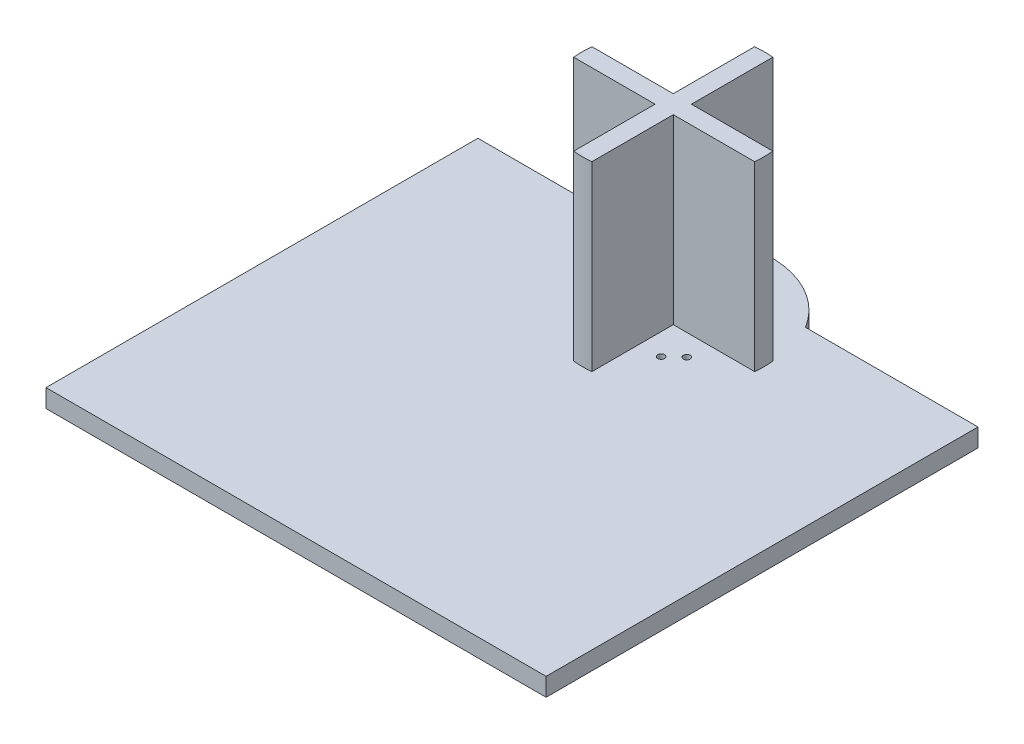
ISO-10303-21;
HEADER;
FILE_DESCRIPTION(('STEP AP214'),'2;1');
FILE_NAME('part.step','',(''),(''),'','','');
FILE_SCHEMA(('AUTOMOTIVE_DESIGN { 1 0 10303 214 1 1 1 1 }'));
ENDSEC;
DATA;
#1=APPLICATION_CONTEXT('core data for automotive mechanical design processes');
#2=APPLICATION_PROTOCOL_DEFINITION('international standard','automotive_design',2000,#1);
#3=PRODUCT_CONTEXT('',#1,'mechanical');
#4=PRODUCT('Part','Part','',(#3));
#5=PRODUCT_RELATED_PRODUCT_CATEGORY('part','',(#4));
#6=PRODUCT_DEFINITION_FORMATION('','',#4);
#7=PRODUCT_DEFINITION_CONTEXT('part definition',#1,'design');
#8=PRODUCT_DEFINITION('design','',#6,#7);
#9=PRODUCT_DEFINITION_SHAPE('','',#8);
#10=(LENGTH_UNIT() NAMED_UNIT(*) SI_UNIT(.MILLI.,.METRE.));
#11=(NAMED_UNIT(*) PLANE_ANGLE_UNIT() SI_UNIT($,.RADIAN.));
#12=(NAMED_UNIT(*) SI_UNIT($,.STERADIAN.) SOLID_ANGLE_UNIT());
#13=UNCERTAINTY_MEASURE_WITH_UNIT(LENGTH_MEASURE(1.E-05),#10,'distance_accuracy_value','');
#14=(GEOMETRIC_REPRESENTATION_CONTEXT(3) GLOBAL_UNCERTAINTY_ASSIGNED_CONTEXT((#13)) GLOBAL_UNIT_ASSIGNED_CONTEXT((#10,
#11,#12)) REPRESENTATION_CONTEXT('',''));
#15=CARTESIAN_POINT('',(0.,0.,0.));
#16=DIRECTION('',(0.,0.,1.));
#17=DIRECTION('',(1.,0.,0.));
#18=AXIS2_PLACEMENT_3D('',#15,#16,#17);
#19=CARTESIAN_POINT('',(55.,44.,-82.9710505503531));
#20=DIRECTION('',(0.,-1.,0.));
#21=DIRECTION('',(0.,0.,-1.));
#22=AXIS2_PLACEMENT_3D('',#19,#20,#21);
#23=CYLINDRICAL_SURFACE('',#22,20.);
#24=DIRECTION('',(0.,-1.,0.));
#25=VECTOR('',#24,1.);
#26=CARTESIAN_POINT('',(74.8997487421324,44.,-80.9710505503531));
#27=LINE('',#26,#25);
#28=CARTESIAN_POINT('',(74.8997487421324,4.,-80.9710505503531));
#29=VERTEX_POINT('',#28);
#30=CARTESIAN_POINT('',(74.8997487421324,44.,-80.9710505503531));
#31=VERTEX_POINT('',#30);
#32=EDGE_CURVE('E239',#29,#31,#27,.F.);
#33=ORIENTED_EDGE('',*,*,#32,.F.);
#34=CARTESIAN_POINT('',(55.,4.,-82.9710505503531));
#35=DIRECTION('',(0.,1.,0.));
#36=DIRECTION('',(0.,0.,1.));
#37=AXIS2_PLACEMENT_3D('',#34,#35,#36);
#38=CIRCLE('',#37,20.);
#39=CARTESIAN_POINT('',(74.8997487421324,4.,-84.9710505503531));
#40=VERTEX_POINT('',#39);
#41=EDGE_CURVE('E247',#29,#40,#38,.T.);
#42=ORIENTED_EDGE('',*,*,#41,.T.);
#43=DIRECTION('',(0.,-1.,0.));
#44=VECTOR('',#43,1.);
#45=CARTESIAN_POINT('',(74.8997487421324,44.,-84.9710505503531));
#46=LINE('',#45,#44);
#47=CARTESIAN_POINT('',(74.8997487421324,44.,-84.9710505503531));
#48=VERTEX_POINT('',#47);
#49=EDGE_CURVE('E229',#40,#48,#46,.F.);
#50=ORIENTED_EDGE('',*,*,#49,.T.);
#51=CARTESIAN_POINT('',(55.,44.,-82.9710505503531));
#52=DIRECTION('',(0.,1.,0.));
#53=DIRECTION('',(0.,0.,1.));
#54=AXIS2_PLACEMENT_3D('',#51,#52,#53);
#55=CIRCLE('',#54,20.);
#56=EDGE_CURVE('E248',#31,#48,#55,.T.);
#57=ORIENTED_EDGE('',*,*,#56,.F.);
#58=EDGE_LOOP('',(#33,#42,#50,#57));
#59=FACE_BOUND('',#58,.T.);
#60=ADVANCED_FACE('F39',(#59),#23,.T.);
#61=DIRECTION('',(0.,-1.,0.));
#62=VECTOR('',#61,1.);
#63=CARTESIAN_POINT('',(35.1002512578676,44.,-84.9710505503531));
#64=LINE('',#63,#62);
#65=CARTESIAN_POINT('',(35.1002512578676,4.,-84.9710505503531));
#66=VERTEX_POINT('',#65);
#67=CARTESIAN_POINT('',(35.1002512578676,44.,-84.9710505503531));
#68=VERTEX_POINT('',#67);
#69=EDGE_CURVE('E64',#66,#68,#64,.F.);
#70=ORIENTED_EDGE('',*,*,#69,.F.);
#71=CARTESIAN_POINT('',(35.1002512578676,4.,-80.9710505503531));
#72=VERTEX_POINT('',#71);
#73=EDGE_CURVE('E251',#66,#72,#38,.T.);
#74=ORIENTED_EDGE('',*,*,#73,.T.);
#75=DIRECTION('',(0.,-1.,0.));
#76=VECTOR('',#75,1.);
#77=CARTESIAN_POINT('',(35.1002512578676,44.,-80.9710505503531));
#78=LINE('',#77,#76);
#79=CARTESIAN_POINT('',(35.1002512578676,44.,-80.9710505503531));
#80=VERTEX_POINT('',#79);
#81=EDGE_CURVE('E233',#72,#80,#78,.F.);
#82=ORIENTED_EDGE('',*,*,#81,.T.);
#83=EDGE_CURVE('E187',#68,#80,#55,.T.);
#84=ORIENTED_EDGE('',*,*,#83,.F.);
#85=EDGE_LOOP('',(#70,#74,#82,#84));
#86=FACE_BOUND('',#85,.T.);
#87=ADVANCED_FACE('F327',(#86),#23,.T.);
#88=CARTESIAN_POINT('',(53.,4.,-63.0713018082207));
#89=VERTEX_POINT('',#88);
#90=CARTESIAN_POINT('',(57.,4.,-63.0713018082207));
#91=VERTEX_POINT('',#90);
#92=EDGE_CURVE('E244',#89,#91,#38,.T.);
#93=ORIENTED_EDGE('',*,*,#92,.T.);
#94=DIRECTION('',(0.,-1.,0.));
#95=VECTOR('',#94,1.);
#96=CARTESIAN_POINT('',(57.,44.,-63.0713018082207));
#97=LINE('',#96,#95);
#98=CARTESIAN_POINT('',(57.,44.,-63.0713018082207));
#99=VERTEX_POINT('',#98);
#100=EDGE_CURVE('E241',#91,#99,#97,.F.);
#101=ORIENTED_EDGE('',*,*,#100,.T.);
#102=CARTESIAN_POINT('',(53.,44.,-63.0713018082207));
#103=VERTEX_POINT('',#102);
#104=EDGE_CURVE('E245',#103,#99,#55,.T.);
#105=ORIENTED_EDGE('',*,*,#104,.F.);
#106=DIRECTION('',(0.,-1.,0.));
#107=VECTOR('',#106,1.);
#108=CARTESIAN_POINT('',(53.,44.,-63.0713018082207));
#109=LINE('',#108,#107);
#110=EDGE_CURVE('E56',#89,#103,#109,.F.);
#111=ORIENTED_EDGE('',*,*,#110,.F.);
#112=EDGE_LOOP('',(#93,#101,#105,#111));
#113=FACE_BOUND('',#112,.T.);
#114=ADVANCED_FACE('F330',(#113),#23,.T.);
#115=CARTESIAN_POINT('',(55.,4.,-84.5433123667573));
#116=DIRECTION('',(0.,-1.,0.));
#117=DIRECTION('',(0.,0.,-1.));
#118=AXIS2_PLACEMENT_3D('',#115,#116,#117);
#119=CYLINDRICAL_SURFACE('',#118,20.);
#120=CARTESIAN_POINT('',(55.,0.,-84.5433123667573));
#121=DIRECTION('',(0.,1.,0.));
#122=DIRECTION('',(0.,0.,1.));
#123=AXIS2_PLACEMENT_3D('',#120,#121,#122);
#124=CIRCLE('',#123,20.);
#125=CARTESIAN_POINT('',(72.0486856895419,0.,-95.));
#126=VERTEX_POINT('',#125);
#127=CARTESIAN_POINT('',(37.9513143104581,0.,-95.));
#128=VERTEX_POINT('',#127);
#129=EDGE_CURVE('E254',#126,#128,#124,.T.);
#130=ORIENTED_EDGE('',*,*,#129,.T.);
#131=DIRECTION('',(0.,-1.,0.));
#132=VECTOR('',#131,1.);
#133=CARTESIAN_POINT('',(37.9513143104581,4.,-95.));
#134=LINE('',#133,#132);
#135=CARTESIAN_POINT('',(37.9513143104581,4.,-95.));
#136=VERTEX_POINT('',#135);
#137=EDGE_CURVE('E48',#136,#128,#134,.T.);
#138=ORIENTED_EDGE('',*,*,#137,.F.);
#139=CARTESIAN_POINT('',(55.,4.,-84.5433123667573));
#140=DIRECTION('',(0.,1.,0.));
#141=DIRECTION('',(0.,0.,1.));
#142=AXIS2_PLACEMENT_3D('',#139,#140,#141);
#143=CIRCLE('',#142,20.);
#144=CARTESIAN_POINT('',(72.0486856895419,4.,-95.));
#145=VERTEX_POINT('',#144);
#146=EDGE_CURVE('E252',#145,#136,#143,.T.);
#147=ORIENTED_EDGE('',*,*,#146,.F.);
#148=DIRECTION('',(0.,-1.,0.));
#149=VECTOR('',#148,1.);
#150=CARTESIAN_POINT('',(72.0486856895419,4.,-95.));
#151=LINE('',#150,#149);
#152=EDGE_CURVE('E11',#145,#126,#151,.T.);
#153=ORIENTED_EDGE('',*,*,#152,.T.);
#154=EDGE_LOOP('',(#130,#138,#147,#153));
#155=FACE_BOUND('',#154,.T.);
#156=ADVANCED_FACE('F373',(#155),#119,.T.);
#157=CARTESIAN_POINT('',(0.,4.,0.));
#158=DIRECTION('',(0.,1.,0.));
#159=DIRECTION('',(0.,0.,1.));
#160=AXIS2_PLACEMENT_3D('',#157,#158,#159);
#161=PLANE('',#160);
#162=CARTESIAN_POINT('',(48.2613795460864,4.,-92.3869300173368));
#163=DIRECTION('',(0.,1.,0.));
#164=DIRECTION('',(0.,0.,1.));
#165=AXIS2_PLACEMENT_3D('',#162,#163,#164);
#166=CIRCLE('',#165,0.749999999999999);
#167=CARTESIAN_POINT('',(48.2613795460864,4.,-91.6369300173368));
#168=VERTEX_POINT('',#167);
#169=EDGE_CURVE('E579',#168,#168,#166,.T.);
#170=ORIENTED_EDGE('',*,*,#169,.F.);
#171=EDGE_LOOP('',(#170));
#172=FACE_BOUND('',#171,.T.);
#173=CARTESIAN_POINT('',(61.7386204539136,4.,-92.3869300173368));
#174=DIRECTION('',(0.,1.,0.));
#175=DIRECTION('',(0.,0.,-1.));
#176=AXIS2_PLACEMENT_3D('',#173,#174,#175);
#177=CIRCLE('',#176,0.749999999999999);
#178=CARTESIAN_POINT('',(61.7386204539136,4.,-93.1369300173368));
#179=VERTEX_POINT('',#178);
#180=EDGE_CURVE('E584',#179,#179,#177,.T.);
#181=ORIENTED_EDGE('',*,*,#180,.F.);
#182=EDGE_LOOP('',(#181));
#183=FACE_BOUND('',#182,.T.);
#184=CARTESIAN_POINT('',(64.6752850109947,4.,-89.6710505503531));
#185=DIRECTION('',(0.,1.,0.));
#186=DIRECTION('',(0.,0.,-1.));
#187=AXIS2_PLACEMENT_3D('',#184,#185,#186);
#188=CIRCLE('',#187,0.749999999999999);
#189=CARTESIAN_POINT('',(64.6752850109947,4.,-90.4210505503531));
#190=VERTEX_POINT('',#189);
#191=EDGE_CURVE('E595',#190,#190,#188,.T.);
#192=ORIENTED_EDGE('',*,*,#191,.F.);
#193=EDGE_LOOP('',(#192));
#194=FACE_BOUND('',#193,.T.);
#195=CARTESIAN_POINT('',(64.6752850109947,4.,-76.2710505503531));
#196=DIRECTION('',(0.,1.,0.));
#197=DIRECTION('',(0.,0.,1.));
#198=AXIS2_PLACEMENT_3D('',#195,#196,#197);
#199=CIRCLE('',#198,0.749999999999999);
#200=CARTESIAN_POINT('',(64.6752850109947,4.,-75.5210505503531));
#201=VERTEX_POINT('',#200);
#202=EDGE_CURVE('E601',#201,#201,#199,.T.);
#203=ORIENTED_EDGE('',*,*,#202,.F.);
#204=EDGE_LOOP('',(#203));
#205=FACE_BOUND('',#204,.T.);
#206=CARTESIAN_POINT('',(61.7386204539136,4.,-73.5551710833695));
#207=DIRECTION('',(0.,1.,0.));
#208=DIRECTION('',(0.,0.,1.));
#209=AXIS2_PLACEMENT_3D('',#206,#207,#208);
#210=CIRCLE('',#209,0.749999999999999);
#211=CARTESIAN_POINT('',(61.7386204539136,4.,-72.8051710833695));
#212=VERTEX_POINT('',#211);
#213=EDGE_CURVE('E607',#212,#212,#210,.T.);
#214=ORIENTED_EDGE('',*,*,#213,.F.);
#215=EDGE_LOOP('',(#214));
#216=FACE_BOUND('',#215,.T.);
#217=CARTESIAN_POINT('',(48.2613795460864,4.,-73.5551710833695));
#218=DIRECTION('',(0.,1.,0.));
#219=DIRECTION('',(0.,0.,-1.));
#220=AXIS2_PLACEMENT_3D('',#217,#218,#219);
#221=CIRCLE('',#220,0.749999999999999);
#222=CARTESIAN_POINT('',(48.2613795460864,4.,-74.3051710833695));
#223=VERTEX_POINT('',#222);
#224=EDGE_CURVE('E629',#223,#223,#221,.T.);
#225=ORIENTED_EDGE('',*,*,#224,.F.);
#226=EDGE_LOOP('',(#225));
#227=FACE_BOUND('',#226,.T.);
#228=CARTESIAN_POINT('',(45.3247149890053,4.,-76.2710505503531));
#229=DIRECTION('',(0.,1.,0.));
#230=DIRECTION('',(0.,0.,-1.));
#231=AXIS2_PLACEMENT_3D('',#228,#229,#230);
#232=CIRCLE('',#231,0.749999999999999);
#233=CARTESIAN_POINT('',(45.3247149890053,4.,-77.0210505503532));
#234=VERTEX_POINT('',#233);
#235=EDGE_CURVE('E636',#234,#234,#232,.T.);
#236=ORIENTED_EDGE('',*,*,#235,.F.);
#237=EDGE_LOOP('',(#236));
#238=FACE_BOUND('',#237,.T.);
#239=CARTESIAN_POINT('',(45.3247149890053,4.,-89.6710505503531));
#240=DIRECTION('',(0.,1.,0.));
#241=DIRECTION('',(0.,0.,1.));
#242=AXIS2_PLACEMENT_3D('',#239,#240,#241);
#243=CIRCLE('',#242,0.749999999999999);
#244=CARTESIAN_POINT('',(45.3247149890053,4.,-88.9210505503531));
#245=VERTEX_POINT('',#244);
#246=EDGE_CURVE('E580',#245,#245,#243,.T.);
#247=ORIENTED_EDGE('',*,*,#246,.F.);
#248=EDGE_LOOP('',(#247));
#249=FACE_BOUND('',#248,.T.);
#250=ORIENTED_EDGE('',*,*,#146,.T.);
#251=DIRECTION('',(1.,0.,0.));
#252=VECTOR('',#251,1.);
#253=CARTESIAN_POINT('',(0.,4.,-95.));
#254=LINE('',#253,#252);
#255=CARTESIAN_POINT('',(0.,4.,-95.));
#256=VERTEX_POINT('',#255);
#257=EDGE_CURVE('E259',#256,#136,#254,.T.);
#258=ORIENTED_EDGE('',*,*,#257,.F.);
#259=DIRECTION('',(0.,0.,-1.));
#260=VECTOR('',#259,1.);
#261=CARTESIAN_POINT('',(0.,4.,0.));
#262=LINE('',#261,#260);
#263=CARTESIAN_POINT('',(0.,4.,0.));
#264=VERTEX_POINT('',#263);
#265=EDGE_CURVE('E267',#264,#256,#262,.T.);
#266=ORIENTED_EDGE('',*,*,#265,.F.);
#267=DIRECTION('',(1.,0.,0.));
#268=VECTOR('',#267,1.);
#269=CARTESIAN_POINT('',(0.,4.,0.));
#270=LINE('',#269,#268);
#271=CARTESIAN_POINT('',(110.,4.,0.));
#272=VERTEX_POINT('',#271);
#273=EDGE_CURVE('E265',#264,#272,#270,.T.);
#274=ORIENTED_EDGE('',*,*,#273,.T.);
#275=DIRECTION('',(0.,0.,-1.));
#276=VECTOR('',#275,1.);
#277=CARTESIAN_POINT('',(110.,4.,0.));
#278=LINE('',#277,#276);
#279=CARTESIAN_POINT('',(110.,4.,-95.));
#280=VERTEX_POINT('',#279);
#281=EDGE_CURVE('E262',#272,#280,#278,.T.);
#282=ORIENTED_EDGE('',*,*,#281,.T.);
#283=EDGE_CURVE('E263',#145,#280,#254,.T.);
#284=ORIENTED_EDGE('',*,*,#283,.F.);
#285=EDGE_LOOP('',(#250,#258,#266,#274,#282,#284));
#286=FACE_BOUND('',#285,.T.);
#287=DIRECTION('',(0.,0.,-1.));
#288=VECTOR('',#287,1.);
#289=CARTESIAN_POINT('',(53.,4.,-84.9710505503531));
#290=LINE('',#289,#288);
#291=CARTESIAN_POINT('',(53.,4.,-84.9710505503531));
#292=VERTEX_POINT('',#291);
#293=CARTESIAN_POINT('',(53.,4.,-102.870799292486));
#294=VERTEX_POINT('',#293);
#295=EDGE_CURVE('E190',#292,#294,#290,.T.);
#296=ORIENTED_EDGE('',*,*,#295,.T.);
#297=CARTESIAN_POINT('',(57.,4.,-102.870799292486));
#298=VERTEX_POINT('',#297);
#299=EDGE_CURVE('E315',#298,#294,#38,.T.);
#300=ORIENTED_EDGE('',*,*,#299,.F.);
#301=DIRECTION('',(0.,0.,-1.));
#302=VECTOR('',#301,1.);
#303=CARTESIAN_POINT('',(57.,4.,-84.9710505503531));
#304=LINE('',#303,#302);
#305=CARTESIAN_POINT('',(57.,4.,-84.9710505503531));
#306=VERTEX_POINT('',#305);
#307=EDGE_CURVE('E219',#306,#298,#304,.T.);
#308=ORIENTED_EDGE('',*,*,#307,.F.);
#309=DIRECTION('',(1.,0.,0.));
#310=VECTOR('',#309,1.);
#311=CARTESIAN_POINT('',(57.,4.,-84.9710505503531));
#312=LINE('',#311,#310);
#313=EDGE_CURVE('E216',#306,#40,#312,.T.);
#314=ORIENTED_EDGE('',*,*,#313,.T.);
#315=ORIENTED_EDGE('',*,*,#41,.F.);
#316=DIRECTION('',(1.,0.,0.));
#317=VECTOR('',#316,1.);
#318=CARTESIAN_POINT('',(57.,4.,-80.9710505503531));
#319=LINE('',#318,#317);
#320=CARTESIAN_POINT('',(57.,4.,-80.9710505503531));
#321=VERTEX_POINT('',#320);
#322=EDGE_CURVE('E202',#321,#29,#319,.T.);
#323=ORIENTED_EDGE('',*,*,#322,.F.);
#324=DIRECTION('',(0.,0.,1.));
#325=VECTOR('',#324,1.);
#326=CARTESIAN_POINT('',(57.,4.,-80.9710505503531));
#327=LINE('',#326,#325);
#328=EDGE_CURVE('E197',#321,#91,#327,.T.);
#329=ORIENTED_EDGE('',*,*,#328,.T.);
#330=ORIENTED_EDGE('',*,*,#92,.F.);
#331=DIRECTION('',(0.,0.,1.));
#332=VECTOR('',#331,1.);
#333=CARTESIAN_POINT('',(53.,4.,-80.9710505503531));
#334=LINE('',#333,#332);
#335=CARTESIAN_POINT('',(53.,4.,-80.9710505503531));
#336=VERTEX_POINT('',#335);
#337=EDGE_CURVE('E174',#336,#89,#334,.T.);
#338=ORIENTED_EDGE('',*,*,#337,.F.);
#339=DIRECTION('',(-1.,0.,0.));
#340=VECTOR('',#339,1.);
#341=CARTESIAN_POINT('',(53.,4.,-80.9710505503531));
#342=LINE('',#341,#340);
#343=EDGE_CURVE('E172',#336,#72,#342,.T.);
#344=ORIENTED_EDGE('',*,*,#343,.T.);
#345=ORIENTED_EDGE('',*,*,#73,.F.);
#346=DIRECTION('',(-1.,0.,0.));
#347=VECTOR('',#346,1.);
#348=CARTESIAN_POINT('',(53.,4.,-84.9710505503531));
#349=LINE('',#348,#347);
#350=EDGE_CURVE('E211',#292,#66,#349,.T.);
#351=ORIENTED_EDGE('',*,*,#350,.F.);
#352=EDGE_LOOP('',(#296,#300,#308,#314,#315,#323,#329,#330,#338,#344,#345,#351));
#353=FACE_BOUND('',#352,.T.);
#354=ADVANCED_FACE('F321',(#172,#183,#194,#205,#216,#227,#238,#249,#286,#353),#161,.T.);
#355=CARTESIAN_POINT('',(0.,0.,0.));
#356=DIRECTION('',(0.,1.,0.));
#357=DIRECTION('',(0.,0.,1.));
#358=AXIS2_PLACEMENT_3D('',#355,#356,#357);
#359=PLANE('',#358);
#360=CARTESIAN_POINT('',(48.2613795460864,0.,-92.3869300173368));
#361=DIRECTION('',(0.,1.,0.));
#362=DIRECTION('',(0.,0.,1.));
#363=AXIS2_PLACEMENT_3D('',#360,#361,#362);
#364=CIRCLE('',#363,0.749999999999999);
#365=CARTESIAN_POINT('',(48.2613795460864,0.,-91.6369300173368));
#366=VERTEX_POINT('',#365);
#367=EDGE_CURVE('E576',#366,#366,#364,.T.);
#368=ORIENTED_EDGE('',*,*,#367,.T.);
#369=EDGE_LOOP('',(#368));
#370=FACE_BOUND('',#369,.T.);
#371=CARTESIAN_POINT('',(61.7386204539136,0.,-92.3869300173368));
#372=DIRECTION('',(0.,1.,0.));
#373=DIRECTION('',(0.,0.,-1.));
#374=AXIS2_PLACEMENT_3D('',#371,#372,#373);
#375=CIRCLE('',#374,0.749999999999999);
#376=CARTESIAN_POINT('',(61.7386204539136,0.,-93.1369300173368));
#377=VERTEX_POINT('',#376);
#378=EDGE_CURVE('E592',#377,#377,#375,.T.);
#379=ORIENTED_EDGE('',*,*,#378,.T.);
#380=EDGE_LOOP('',(#379));
#381=FACE_BOUND('',#380,.T.);
#382=CARTESIAN_POINT('',(64.6752850109947,0.,-89.6710505503531));
#383=DIRECTION('',(0.,1.,0.));
#384=DIRECTION('',(0.,0.,-1.));
#385=AXIS2_PLACEMENT_3D('',#382,#383,#384);
#386=CIRCLE('',#385,0.749999999999999);
#387=CARTESIAN_POINT('',(64.6752850109947,0.,-90.4210505503531));
#388=VERTEX_POINT('',#387);
#389=EDGE_CURVE('E598',#388,#388,#386,.T.);
#390=ORIENTED_EDGE('',*,*,#389,.T.);
#391=EDGE_LOOP('',(#390));
#392=FACE_BOUND('',#391,.T.);
#393=CARTESIAN_POINT('',(64.6752850109947,0.,-76.2710505503531));
#394=DIRECTION('',(0.,1.,0.));
#395=DIRECTION('',(0.,0.,1.));
#396=AXIS2_PLACEMENT_3D('',#393,#394,#395);
#397=CIRCLE('',#396,0.749999999999999);
#398=CARTESIAN_POINT('',(64.6752850109947,0.,-75.5210505503531));
#399=VERTEX_POINT('',#398);
#400=EDGE_CURVE('E604',#399,#399,#397,.T.);
#401=ORIENTED_EDGE('',*,*,#400,.T.);
#402=EDGE_LOOP('',(#401));
#403=FACE_BOUND('',#402,.T.);
#404=CARTESIAN_POINT('',(61.7386204539136,0.,-73.5551710833695));
#405=DIRECTION('',(0.,1.,0.));
#406=DIRECTION('',(0.,0.,1.));
#407=AXIS2_PLACEMENT_3D('',#404,#405,#406);
#408=CIRCLE('',#407,0.749999999999999);
#409=CARTESIAN_POINT('',(61.7386204539136,0.,-72.8051710833695));
#410=VERTEX_POINT('',#409);
#411=EDGE_CURVE('E624',#410,#410,#408,.T.);
#412=ORIENTED_EDGE('',*,*,#411,.T.);
#413=EDGE_LOOP('',(#412));
#414=FACE_BOUND('',#413,.T.);
#415=CARTESIAN_POINT('',(48.2613795460864,0.,-73.5551710833695));
#416=DIRECTION('',(0.,1.,0.));
#417=DIRECTION('',(0.,0.,-1.));
#418=AXIS2_PLACEMENT_3D('',#415,#416,#417);
#419=CIRCLE('',#418,0.749999999999999);
#420=CARTESIAN_POINT('',(48.2613795460864,0.,-74.3051710833695));
#421=VERTEX_POINT('',#420);
#422=EDGE_CURVE('E634',#421,#421,#419,.T.);
#423=ORIENTED_EDGE('',*,*,#422,.T.);
#424=EDGE_LOOP('',(#423));
#425=FACE_BOUND('',#424,.T.);
#426=CARTESIAN_POINT('',(45.3247149890053,0.,-76.2710505503531));
#427=DIRECTION('',(0.,1.,0.));
#428=DIRECTION('',(0.,0.,-1.));
#429=AXIS2_PLACEMENT_3D('',#426,#427,#428);
#430=CIRCLE('',#429,0.749999999999999);
#431=CARTESIAN_POINT('',(45.3247149890053,0.,-77.0210505503532));
#432=VERTEX_POINT('',#431);
#433=EDGE_CURVE('E587',#432,#432,#430,.T.);
#434=ORIENTED_EDGE('',*,*,#433,.T.);
#435=EDGE_LOOP('',(#434));
#436=FACE_BOUND('',#435,.T.);
#437=CARTESIAN_POINT('',(45.3247149890053,0.,-89.6710505503531));
#438=DIRECTION('',(0.,1.,0.));
#439=DIRECTION('',(0.,0.,1.));
#440=AXIS2_PLACEMENT_3D('',#437,#438,#439);
#441=CIRCLE('',#440,0.749999999999999);
#442=CARTESIAN_POINT('',(45.3247149890053,0.,-88.9210505503531));
#443=VERTEX_POINT('',#442);
#444=EDGE_CURVE('E175',#443,#443,#441,.T.);
#445=ORIENTED_EDGE('',*,*,#444,.T.);
#446=EDGE_LOOP('',(#445));
#447=FACE_BOUND('',#446,.T.);
#448=ORIENTED_EDGE('',*,*,#129,.F.);
#449=DIRECTION('',(1.,0.,0.));
#450=VECTOR('',#449,1.);
#451=CARTESIAN_POINT('',(0.,0.,-95.));
#452=LINE('',#451,#450);
#453=CARTESIAN_POINT('',(110.,0.,-95.));
#454=VERTEX_POINT('',#453);
#455=EDGE_CURVE('E274',#126,#454,#452,.T.);
#456=ORIENTED_EDGE('',*,*,#455,.T.);
#457=DIRECTION('',(0.,0.,-1.));
#458=VECTOR('',#457,1.);
#459=CARTESIAN_POINT('',(110.,0.,0.));
#460=LINE('',#459,#458);
#461=CARTESIAN_POINT('',(110.,0.,0.));
#462=VERTEX_POINT('',#461);
#463=EDGE_CURVE('E273',#462,#454,#460,.T.);
#464=ORIENTED_EDGE('',*,*,#463,.F.);
#465=DIRECTION('',(1.,0.,0.));
#466=VECTOR('',#465,1.);
#467=CARTESIAN_POINT('',(0.,0.,0.));
#468=LINE('',#467,#466);
#469=CARTESIAN_POINT('',(0.,0.,0.));
#470=VERTEX_POINT('',#469);
#471=EDGE_CURVE('E277',#470,#462,#468,.T.);
#472=ORIENTED_EDGE('',*,*,#471,.F.);
#473=DIRECTION('',(0.,0.,-1.));
#474=VECTOR('',#473,1.);
#475=CARTESIAN_POINT('',(0.,0.,0.));
#476=LINE('',#475,#474);
#477=CARTESIAN_POINT('',(0.,0.,-95.));
#478=VERTEX_POINT('',#477);
#479=EDGE_CURVE('E279',#470,#478,#476,.T.);
#480=ORIENTED_EDGE('',*,*,#479,.T.);
#481=EDGE_CURVE('E270',#478,#128,#452,.T.);
#482=ORIENTED_EDGE('',*,*,#481,.T.);
#483=EDGE_LOOP('',(#448,#456,#464,#472,#480,#482));
#484=FACE_BOUND('',#483,.T.);
#485=ADVANCED_FACE('F300',(#370,#381,#392,#403,#414,#425,#436,#447,#484),#359,.F.);
#486=CARTESIAN_POINT('',(0.,4.,0.));
#487=DIRECTION('',(-1.,0.,0.));
#488=DIRECTION('',(0.,0.,1.));
#489=AXIS2_PLACEMENT_3D('',#486,#487,#488);
#490=PLANE('',#489);
#491=ORIENTED_EDGE('',*,*,#479,.F.);
#492=DIRECTION('',(0.,-1.,0.));
#493=VECTOR('',#492,1.);
#494=CARTESIAN_POINT('',(0.,4.,0.));
#495=LINE('',#494,#493);
#496=EDGE_CURVE('E283',#264,#470,#495,.T.);
#497=ORIENTED_EDGE('',*,*,#496,.F.);
#498=ORIENTED_EDGE('',*,*,#265,.T.);
#499=DIRECTION('',(0.,-1.,0.));
#500=VECTOR('',#499,1.);
#501=CARTESIAN_POINT('',(0.,4.,-95.));
#502=LINE('',#501,#500);
#503=EDGE_CURVE('E257',#256,#478,#502,.T.);
#504=ORIENTED_EDGE('',*,*,#503,.T.);
#505=EDGE_LOOP('',(#491,#497,#498,#504));
#506=FACE_BOUND('',#505,.T.);
#507=ADVANCED_FACE('F371',(#506),#490,.T.);
#508=CARTESIAN_POINT('',(0.,4.,0.));
#509=DIRECTION('',(0.,0.,-1.));
#510=DIRECTION('',(-1.,0.,0.));
#511=AXIS2_PLACEMENT_3D('',#508,#509,#510);
#512=PLANE('',#511);
#513=ORIENTED_EDGE('',*,*,#471,.T.);
#514=DIRECTION('',(0.,-1.,0.));
#515=VECTOR('',#514,1.);
#516=CARTESIAN_POINT('',(110.,4.,0.));
#517=LINE('',#516,#515);
#518=EDGE_CURVE('E284',#272,#462,#517,.T.);
#519=ORIENTED_EDGE('',*,*,#518,.F.);
#520=ORIENTED_EDGE('',*,*,#273,.F.);
#521=ORIENTED_EDGE('',*,*,#496,.T.);
#522=EDGE_LOOP('',(#513,#519,#520,#521));
#523=FACE_BOUND('',#522,.T.);
#524=ADVANCED_FACE('F382',(#523),#512,.F.);
#525=CARTESIAN_POINT('',(110.,4.,0.));
#526=DIRECTION('',(-1.,0.,0.));
#527=DIRECTION('',(0.,0.,1.));
#528=AXIS2_PLACEMENT_3D('',#525,#526,#527);
#529=PLANE('',#528);
#530=ORIENTED_EDGE('',*,*,#463,.T.);
#531=DIRECTION('',(0.,-1.,0.));
#532=VECTOR('',#531,1.);
#533=CARTESIAN_POINT('',(110.,4.,-95.));
#534=LINE('',#533,#532);
#535=EDGE_CURVE('E43',#280,#454,#534,.T.);
#536=ORIENTED_EDGE('',*,*,#535,.F.);
#537=ORIENTED_EDGE('',*,*,#281,.F.);
#538=ORIENTED_EDGE('',*,*,#518,.T.);
#539=EDGE_LOOP('',(#530,#536,#537,#538));
#540=FACE_BOUND('',#539,.T.);
#541=ADVANCED_FACE('F297',(#540),#529,.F.);
#542=CARTESIAN_POINT('',(0.,4.,-95.));
#543=DIRECTION('',(0.,0.,-1.));
#544=DIRECTION('',(-1.,0.,0.));
#545=AXIS2_PLACEMENT_3D('',#542,#543,#544);
#546=PLANE('',#545);
#547=ORIENTED_EDGE('',*,*,#152,.F.);
#548=ORIENTED_EDGE('',*,*,#283,.T.);
#549=ORIENTED_EDGE('',*,*,#535,.T.);
#550=ORIENTED_EDGE('',*,*,#455,.F.);
#551=EDGE_LOOP('',(#547,#548,#549,#550));
#552=FACE_BOUND('',#551,.T.);
#553=ADVANCED_FACE('F41',(#552),#546,.T.);
#554=ORIENTED_EDGE('',*,*,#137,.T.);
#555=ORIENTED_EDGE('',*,*,#481,.F.);
#556=ORIENTED_EDGE('',*,*,#503,.F.);
#557=ORIENTED_EDGE('',*,*,#257,.T.);
#558=EDGE_LOOP('',(#554,#555,#556,#557));
#559=FACE_BOUND('',#558,.T.);
#560=ADVANCED_FACE('F365',(#559),#546,.T.);
#561=ORIENTED_EDGE('',*,*,#299,.T.);
#562=DIRECTION('',(0.,-1.,0.));
#563=VECTOR('',#562,1.);
#564=CARTESIAN_POINT('',(53.,44.,-102.870799292486));
#565=LINE('',#564,#563);
#566=CARTESIAN_POINT('',(53.,44.,-102.870799292486));
#567=VERTEX_POINT('',#566);
#568=EDGE_CURVE('E236',#294,#567,#565,.F.);
#569=ORIENTED_EDGE('',*,*,#568,.T.);
#570=CARTESIAN_POINT('',(57.,44.,-102.870799292486));
#571=VERTEX_POINT('',#570);
#572=EDGE_CURVE('E303',#571,#567,#55,.T.);
#573=ORIENTED_EDGE('',*,*,#572,.F.);
#574=DIRECTION('',(0.,-1.,0.));
#575=VECTOR('',#574,1.);
#576=CARTESIAN_POINT('',(57.,44.,-102.870799292486));
#577=LINE('',#576,#575);
#578=EDGE_CURVE('E227',#298,#571,#577,.F.);
#579=ORIENTED_EDGE('',*,*,#578,.F.);
#580=EDGE_LOOP('',(#561,#569,#573,#579));
#581=FACE_BOUND('',#580,.T.);
#582=ADVANCED_FACE('F313',(#581),#23,.T.);
#583=CARTESIAN_POINT('',(55.,44.,-82.9710505503531));
#584=DIRECTION('',(0.,1.,0.));
#585=DIRECTION('',(0.,0.,1.));
#586=AXIS2_PLACEMENT_3D('',#583,#584,#585);
#587=PLANE('',#586);
#588=DIRECTION('',(0.,0.,1.));
#589=VECTOR('',#588,1.);
#590=CARTESIAN_POINT('',(57.,44.,-80.9710505503531));
#591=LINE('',#590,#589);
#592=CARTESIAN_POINT('',(57.,44.,-80.9710505503531));
#593=VERTEX_POINT('',#592);
#594=EDGE_CURVE('E199',#593,#99,#591,.T.);
#595=ORIENTED_EDGE('',*,*,#594,.F.);
#596=DIRECTION('',(1.,0.,0.));
#597=VECTOR('',#596,1.);
#598=CARTESIAN_POINT('',(57.,44.,-80.9710505503531));
#599=LINE('',#598,#597);
#600=EDGE_CURVE('E201',#593,#31,#599,.T.);
#601=ORIENTED_EDGE('',*,*,#600,.T.);
#602=ORIENTED_EDGE('',*,*,#56,.T.);
#603=DIRECTION('',(1.,0.,0.));
#604=VECTOR('',#603,1.);
#605=CARTESIAN_POINT('',(57.,44.,-84.9710505503531));
#606=LINE('',#605,#604);
#607=CARTESIAN_POINT('',(57.,44.,-84.9710505503531));
#608=VERTEX_POINT('',#607);
#609=EDGE_CURVE('E205',#608,#48,#606,.T.);
#610=ORIENTED_EDGE('',*,*,#609,.F.);
#611=DIRECTION('',(0.,0.,-1.));
#612=VECTOR('',#611,1.);
#613=CARTESIAN_POINT('',(57.,44.,-84.9710505503531));
#614=LINE('',#613,#612);
#615=EDGE_CURVE('E220',#608,#571,#614,.T.);
#616=ORIENTED_EDGE('',*,*,#615,.T.);
#617=ORIENTED_EDGE('',*,*,#572,.T.);
#618=DIRECTION('',(0.,0.,-1.));
#619=VECTOR('',#618,1.);
#620=CARTESIAN_POINT('',(53.,44.,-84.9710505503531));
#621=LINE('',#620,#619);
#622=CARTESIAN_POINT('',(53.,44.,-84.9710505503531));
#623=VERTEX_POINT('',#622);
#624=EDGE_CURVE('E209',#623,#567,#621,.T.);
#625=ORIENTED_EDGE('',*,*,#624,.F.);
#626=DIRECTION('',(-1.,0.,0.));
#627=VECTOR('',#626,1.);
#628=CARTESIAN_POINT('',(53.,44.,-84.9710505503531));
#629=LINE('',#628,#627);
#630=EDGE_CURVE('E198',#623,#68,#629,.T.);
#631=ORIENTED_EDGE('',*,*,#630,.T.);
#632=ORIENTED_EDGE('',*,*,#83,.T.);
#633=DIRECTION('',(-1.,0.,0.));
#634=VECTOR('',#633,1.);
#635=CARTESIAN_POINT('',(53.,44.,-80.9710505503531));
#636=LINE('',#635,#634);
#637=CARTESIAN_POINT('',(53.,44.,-80.9710505503531));
#638=VERTEX_POINT('',#637);
#639=EDGE_CURVE('E169',#638,#80,#636,.T.);
#640=ORIENTED_EDGE('',*,*,#639,.F.);
#641=DIRECTION('',(0.,0.,1.));
#642=VECTOR('',#641,1.);
#643=CARTESIAN_POINT('',(53.,44.,-80.9710505503531));
#644=LINE('',#643,#642);
#645=EDGE_CURVE('E177',#638,#103,#644,.T.);
#646=ORIENTED_EDGE('',*,*,#645,.T.);
#647=ORIENTED_EDGE('',*,*,#104,.T.);
#648=EDGE_LOOP('',(#595,#601,#602,#610,#616,#617,#625,#631,#632,#640,#646,#647));
#649=FACE_BOUND('',#648,.T.);
#650=ADVANCED_FACE('F185',(#649),#587,.T.);
#651=CARTESIAN_POINT('',(57.,4.,-84.9710505503531));
#652=DIRECTION('',(0.,0.,1.));
#653=DIRECTION('',(1.,0.,0.));
#654=AXIS2_PLACEMENT_3D('',#651,#652,#653);
#655=PLANE('',#654);
#656=ORIENTED_EDGE('',*,*,#313,.F.);
#657=DIRECTION('',(0.,1.,0.));
#658=VECTOR('',#657,1.);
#659=CARTESIAN_POINT('',(57.,4.,-84.9710505503531));
#660=LINE('',#659,#658);
#661=EDGE_CURVE('E222',#306,#608,#660,.T.);
#662=ORIENTED_EDGE('',*,*,#661,.T.);
#663=ORIENTED_EDGE('',*,*,#609,.T.);
#664=ORIENTED_EDGE('',*,*,#49,.F.);
#665=EDGE_LOOP('',(#656,#662,#663,#664));
#666=FACE_BOUND('',#665,.T.);
#667=ADVANCED_FACE('F344',(#666),#655,.F.);
#668=CARTESIAN_POINT('',(57.,4.,-84.9710505503531));
#669=DIRECTION('',(1.,0.,0.));
#670=DIRECTION('',(0.,0.,-1.));
#671=AXIS2_PLACEMENT_3D('',#668,#669,#670);
#672=PLANE('',#671);
#673=ORIENTED_EDGE('',*,*,#578,.T.);
#674=ORIENTED_EDGE('',*,*,#615,.F.);
#675=ORIENTED_EDGE('',*,*,#661,.F.);
#676=ORIENTED_EDGE('',*,*,#307,.T.);
#677=EDGE_LOOP('',(#673,#674,#675,#676));
#678=FACE_BOUND('',#677,.T.);
#679=ADVANCED_FACE('F346',(#678),#672,.T.);
#680=CARTESIAN_POINT('',(53.,4.,-80.9710505503531));
#681=DIRECTION('',(0.,0.,-1.));
#682=DIRECTION('',(-1.,0.,0.));
#683=AXIS2_PLACEMENT_3D('',#680,#681,#682);
#684=PLANE('',#683);
#685=ORIENTED_EDGE('',*,*,#343,.F.);
#686=DIRECTION('',(0.,1.,0.));
#687=VECTOR('',#686,1.);
#688=CARTESIAN_POINT('',(53.,4.,-80.9710505503531));
#689=LINE('',#688,#687);
#690=EDGE_CURVE('E166',#336,#638,#689,.T.);
#691=ORIENTED_EDGE('',*,*,#690,.T.);
#692=ORIENTED_EDGE('',*,*,#639,.T.);
#693=ORIENTED_EDGE('',*,*,#81,.F.);
#694=EDGE_LOOP('',(#685,#691,#692,#693));
#695=FACE_BOUND('',#694,.T.);
#696=ADVANCED_FACE('F167',(#695),#684,.F.);
#697=CARTESIAN_POINT('',(53.,4.,-80.9710505503531));
#698=DIRECTION('',(-1.,0.,0.));
#699=DIRECTION('',(0.,0.,1.));
#700=AXIS2_PLACEMENT_3D('',#697,#698,#699);
#701=PLANE('',#700);
#702=ORIENTED_EDGE('',*,*,#110,.T.);
#703=ORIENTED_EDGE('',*,*,#645,.F.);
#704=ORIENTED_EDGE('',*,*,#690,.F.);
#705=ORIENTED_EDGE('',*,*,#337,.T.);
#706=EDGE_LOOP('',(#702,#703,#704,#705));
#707=FACE_BOUND('',#706,.T.);
#708=ADVANCED_FACE('F178',(#707),#701,.T.);
#709=CARTESIAN_POINT('',(53.,4.,-84.9710505503531));
#710=DIRECTION('',(1.,0.,0.));
#711=DIRECTION('',(0.,0.,-1.));
#712=AXIS2_PLACEMENT_3D('',#709,#710,#711);
#713=PLANE('',#712);
#714=ORIENTED_EDGE('',*,*,#295,.F.);
#715=DIRECTION('',(0.,1.,0.));
#716=VECTOR('',#715,1.);
#717=CARTESIAN_POINT('',(53.,4.,-84.9710505503531));
#718=LINE('',#717,#716);
#719=EDGE_CURVE('E188',#292,#623,#718,.T.);
#720=ORIENTED_EDGE('',*,*,#719,.T.);
#721=ORIENTED_EDGE('',*,*,#624,.T.);
#722=ORIENTED_EDGE('',*,*,#568,.F.);
#723=EDGE_LOOP('',(#714,#720,#721,#722));
#724=FACE_BOUND('',#723,.T.);
#725=ADVANCED_FACE('F318',(#724),#713,.F.);
#726=CARTESIAN_POINT('',(53.,4.,-84.9710505503531));
#727=DIRECTION('',(0.,0.,-1.));
#728=DIRECTION('',(-1.,0.,0.));
#729=AXIS2_PLACEMENT_3D('',#726,#727,#728);
#730=PLANE('',#729);
#731=ORIENTED_EDGE('',*,*,#69,.T.);
#732=ORIENTED_EDGE('',*,*,#630,.F.);
#733=ORIENTED_EDGE('',*,*,#719,.F.);
#734=ORIENTED_EDGE('',*,*,#350,.T.);
#735=EDGE_LOOP('',(#731,#732,#733,#734));
#736=FACE_BOUND('',#735,.T.);
#737=ADVANCED_FACE('F325',(#736),#730,.T.);
#738=CARTESIAN_POINT('',(57.,4.,-80.9710505503531));
#739=DIRECTION('',(-1.,0.,0.));
#740=DIRECTION('',(0.,0.,1.));
#741=AXIS2_PLACEMENT_3D('',#738,#739,#740);
#742=PLANE('',#741);
#743=ORIENTED_EDGE('',*,*,#328,.F.);
#744=DIRECTION('',(0.,1.,0.));
#745=VECTOR('',#744,1.);
#746=CARTESIAN_POINT('',(57.,4.,-80.9710505503531));
#747=LINE('',#746,#745);
#748=EDGE_CURVE('E195',#321,#593,#747,.T.);
#749=ORIENTED_EDGE('',*,*,#748,.T.);
#750=ORIENTED_EDGE('',*,*,#594,.T.);
#751=ORIENTED_EDGE('',*,*,#100,.F.);
#752=EDGE_LOOP('',(#743,#749,#750,#751));
#753=FACE_BOUND('',#752,.T.);
#754=ADVANCED_FACE('F334',(#753),#742,.F.);
#755=CARTESIAN_POINT('',(57.,4.,-80.9710505503531));
#756=DIRECTION('',(0.,0.,1.));
#757=DIRECTION('',(1.,0.,0.));
#758=AXIS2_PLACEMENT_3D('',#755,#756,#757);
#759=PLANE('',#758);
#760=ORIENTED_EDGE('',*,*,#32,.T.);
#761=ORIENTED_EDGE('',*,*,#600,.F.);
#762=ORIENTED_EDGE('',*,*,#748,.F.);
#763=ORIENTED_EDGE('',*,*,#322,.T.);
#764=EDGE_LOOP('',(#760,#761,#762,#763));
#765=FACE_BOUND('',#764,.T.);
#766=ADVANCED_FACE('F337',(#765),#759,.T.);
#767=CARTESIAN_POINT('',(45.3247149890053,0.,-89.6710505503531));
#768=DIRECTION('',(0.,1.,0.));
#769=DIRECTION('',(0.,0.,1.));
#770=AXIS2_PLACEMENT_3D('',#767,#768,#769);
#771=CYLINDRICAL_SURFACE('',#770,0.749999999999999);
#772=ORIENTED_EDGE('',*,*,#444,.F.);
#773=EDGE_LOOP('',(#772));
#774=FACE_BOUND('',#773,.T.);
#775=ORIENTED_EDGE('',*,*,#246,.T.);
#776=EDGE_LOOP('',(#775));
#777=FACE_BOUND('',#776,.T.);
#778=ADVANCED_FACE('F493',(#774,#777),#771,.F.);
#779=CARTESIAN_POINT('',(45.3247149890053,0.,-76.2710505503531));
#780=DIRECTION('',(0.,1.,0.));
#781=DIRECTION('',(0.,0.,1.));
#782=AXIS2_PLACEMENT_3D('',#779,#780,#781);
#783=CYLINDRICAL_SURFACE('',#782,0.749999999999999);
#784=ORIENTED_EDGE('',*,*,#433,.F.);
#785=EDGE_LOOP('',(#784));
#786=FACE_BOUND('',#785,.T.);
#787=ORIENTED_EDGE('',*,*,#235,.T.);
#788=EDGE_LOOP('',(#787));
#789=FACE_BOUND('',#788,.T.);
#790=ADVANCED_FACE('F500',(#786,#789),#783,.F.);
#791=CARTESIAN_POINT('',(48.2613795460864,0.,-73.5551710833695));
#792=DIRECTION('',(0.,1.,0.));
#793=DIRECTION('',(0.,0.,1.));
#794=AXIS2_PLACEMENT_3D('',#791,#792,#793);
#795=CYLINDRICAL_SURFACE('',#794,0.749999999999999);
#796=ORIENTED_EDGE('',*,*,#422,.F.);
#797=EDGE_LOOP('',(#796));
#798=FACE_BOUND('',#797,.T.);
#799=ORIENTED_EDGE('',*,*,#224,.T.);
#800=EDGE_LOOP('',(#799));
#801=FACE_BOUND('',#800,.T.);
#802=ADVANCED_FACE('F509',(#798,#801),#795,.F.);
#803=CARTESIAN_POINT('',(61.7386204539136,0.,-73.5551710833695));
#804=DIRECTION('',(0.,1.,0.));
#805=DIRECTION('',(0.,0.,1.));
#806=AXIS2_PLACEMENT_3D('',#803,#804,#805);
#807=CYLINDRICAL_SURFACE('',#806,0.749999999999999);
#808=ORIENTED_EDGE('',*,*,#411,.F.);
#809=EDGE_LOOP('',(#808));
#810=FACE_BOUND('',#809,.T.);
#811=ORIENTED_EDGE('',*,*,#213,.T.);
#812=EDGE_LOOP('',(#811));
#813=FACE_BOUND('',#812,.T.);
#814=ADVANCED_FACE('F518',(#810,#813),#807,.F.);
#815=CARTESIAN_POINT('',(64.6752850109947,0.,-76.2710505503531));
#816=DIRECTION('',(0.,1.,0.));
#817=DIRECTION('',(0.,0.,1.));
#818=AXIS2_PLACEMENT_3D('',#815,#816,#817);
#819=CYLINDRICAL_SURFACE('',#818,0.749999999999999);
#820=ORIENTED_EDGE('',*,*,#400,.F.);
#821=EDGE_LOOP('',(#820));
#822=FACE_BOUND('',#821,.T.);
#823=ORIENTED_EDGE('',*,*,#202,.T.);
#824=EDGE_LOOP('',(#823));
#825=FACE_BOUND('',#824,.T.);
#826=ADVANCED_FACE('F527',(#822,#825),#819,.F.);
#827=CARTESIAN_POINT('',(64.6752850109947,0.,-89.6710505503531));
#828=DIRECTION('',(0.,1.,0.));
#829=DIRECTION('',(0.,0.,1.));
#830=AXIS2_PLACEMENT_3D('',#827,#828,#829);
#831=CYLINDRICAL_SURFACE('',#830,0.749999999999999);
#832=ORIENTED_EDGE('',*,*,#389,.F.);
#833=EDGE_LOOP('',(#832));
#834=FACE_BOUND('',#833,.T.);
#835=ORIENTED_EDGE('',*,*,#191,.T.);
#836=EDGE_LOOP('',(#835));
#837=FACE_BOUND('',#836,.T.);
#838=ADVANCED_FACE('F536',(#834,#837),#831,.F.);
#839=CARTESIAN_POINT('',(61.7386204539136,0.,-92.3869300173368));
#840=DIRECTION('',(0.,1.,0.));
#841=DIRECTION('',(0.,0.,1.));
#842=AXIS2_PLACEMENT_3D('',#839,#840,#841);
#843=CYLINDRICAL_SURFACE('',#842,0.749999999999999);
#844=ORIENTED_EDGE('',*,*,#378,.F.);
#845=EDGE_LOOP('',(#844));
#846=FACE_BOUND('',#845,.T.);
#847=ORIENTED_EDGE('',*,*,#180,.T.);
#848=EDGE_LOOP('',(#847));
#849=FACE_BOUND('',#848,.T.);
#850=ADVANCED_FACE('F545',(#846,#849),#843,.F.);
#851=CARTESIAN_POINT('',(48.2613795460864,0.,-92.3869300173368));
#852=DIRECTION('',(0.,1.,0.));
#853=DIRECTION('',(0.,0.,1.));
#854=AXIS2_PLACEMENT_3D('',#851,#852,#853);
#855=CYLINDRICAL_SURFACE('',#854,0.749999999999999);
#856=ORIENTED_EDGE('',*,*,#367,.F.);
#857=EDGE_LOOP('',(#856));
#858=FACE_BOUND('',#857,.T.);
#859=ORIENTED_EDGE('',*,*,#169,.T.);
#860=EDGE_LOOP('',(#859));
#861=FACE_BOUND('',#860,.T.);
#862=ADVANCED_FACE('F554',(#858,#861),#855,.F.);
#863=CLOSED_SHELL('',(#60,#87,#114,#156,#354,#485,#507,#524,#541,#553,#560,#582,#650,#667,#679,
#696,#708,#725,#737,#754,#766,#778,#790,#802,#814,#826,#838,#850,#862));
#864=MANIFOLD_SOLID_BREP('B2',#863);
#865=ADVANCED_BREP_SHAPE_REPRESENTATION('',(#18,#864),#14);
#866=SHAPE_DEFINITION_REPRESENTATION(#9,#865);
ENDSEC;
END-ISO-10303-21;
